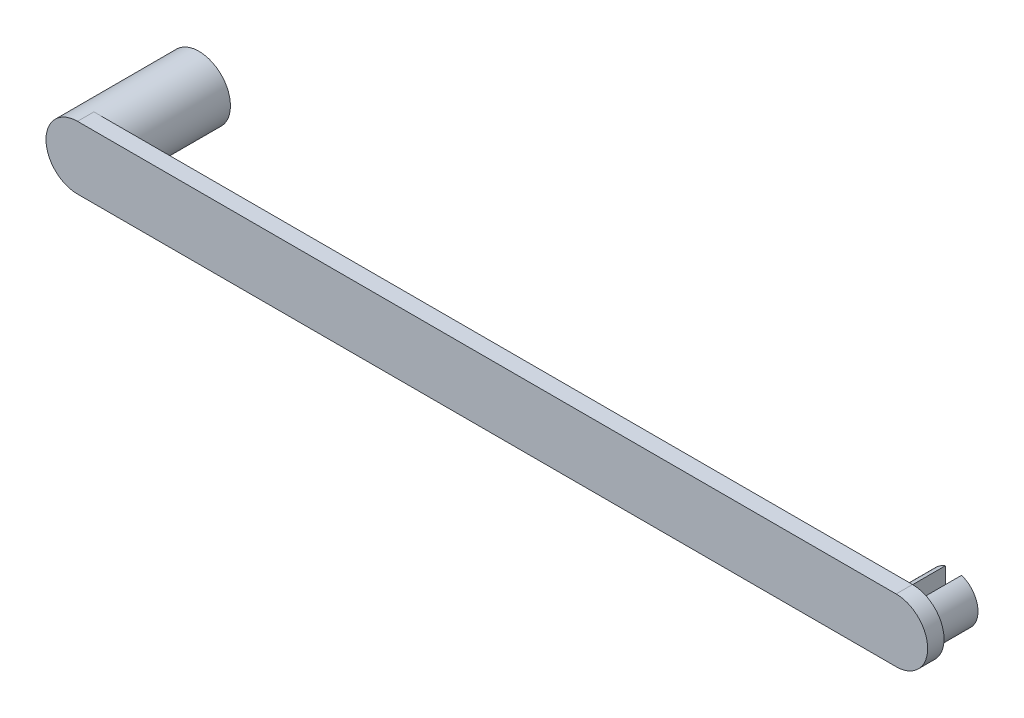
ISO-10303-21;
HEADER;
FILE_DESCRIPTION(('STEP AP214'),'2;1');
FILE_NAME('part.step','',(''),(''),'','','');
FILE_SCHEMA(('AUTOMOTIVE_DESIGN { 1 0 10303 214 1 1 1 1 }'));
ENDSEC;
DATA;
#1=APPLICATION_CONTEXT('core data for automotive mechanical design processes');
#2=APPLICATION_PROTOCOL_DEFINITION('international standard','automotive_design',2000,#1);
#3=PRODUCT_CONTEXT('',#1,'mechanical');
#4=PRODUCT('Part','Part','',(#3));
#5=PRODUCT_RELATED_PRODUCT_CATEGORY('part','',(#4));
#6=PRODUCT_DEFINITION_FORMATION('','',#4);
#7=PRODUCT_DEFINITION_CONTEXT('part definition',#1,'design');
#8=PRODUCT_DEFINITION('design','',#6,#7);
#9=PRODUCT_DEFINITION_SHAPE('','',#8);
#10=(LENGTH_UNIT() NAMED_UNIT(*) SI_UNIT(.MILLI.,.METRE.));
#11=(NAMED_UNIT(*) PLANE_ANGLE_UNIT() SI_UNIT($,.RADIAN.));
#12=(NAMED_UNIT(*) SI_UNIT($,.STERADIAN.) SOLID_ANGLE_UNIT());
#13=UNCERTAINTY_MEASURE_WITH_UNIT(LENGTH_MEASURE(1.E-05),#10,'distance_accuracy_value','');
#14=(GEOMETRIC_REPRESENTATION_CONTEXT(3) GLOBAL_UNCERTAINTY_ASSIGNED_CONTEXT((#13)) GLOBAL_UNIT_ASSIGNED_CONTEXT((#10,
#11,#12)) REPRESENTATION_CONTEXT('',''));
#15=CARTESIAN_POINT('',(0.,0.,0.));
#16=DIRECTION('',(0.,0.,1.));
#17=DIRECTION('',(1.,0.,0.));
#18=AXIS2_PLACEMENT_3D('',#15,#16,#17);
#19=CARTESIAN_POINT('',(0.,0.,12.83));
#20=DIRECTION('',(0.,0.,1.));
#21=DIRECTION('',(1.,0.,0.));
#22=AXIS2_PLACEMENT_3D('',#19,#20,#21);
#23=PLANE('',#22);
#24=DIRECTION('',(0.,-1.,0.));
#25=VECTOR('',#24,1.);
#26=CARTESIAN_POINT('',(99.,0.,12.83));
#27=LINE('',#26,#25);
#28=CARTESIAN_POINT('',(99.,2.8284271247462,12.83));
#29=VERTEX_POINT('',#28);
#30=CARTESIAN_POINT('',(99.,-2.8284271247462,12.83));
#31=VERTEX_POINT('',#30);
#32=EDGE_CURVE('E114',#29,#31,#27,.T.);
#33=ORIENTED_EDGE('',*,*,#32,.F.);
#34=CARTESIAN_POINT('',(100.,0.,12.83));
#35=DIRECTION('',(0.,0.,-1.));
#36=DIRECTION('',(-1.,0.,0.));
#37=AXIS2_PLACEMENT_3D('',#34,#35,#36);
#38=CIRCLE('',#37,3.00000000000001);
#39=EDGE_CURVE('E49',#31,#29,#38,.T.);
#40=ORIENTED_EDGE('',*,*,#39,.F.);
#41=EDGE_LOOP('',(#33,#40));
#42=FACE_BOUND('',#41,.T.);
#43=DIRECTION('',(1.,0.,0.));
#44=VECTOR('',#43,1.);
#45=CARTESIAN_POINT('',(0.,-3.85,12.83));
#46=LINE('',#45,#44);
#47=CARTESIAN_POINT('',(0.,-3.85,12.83));
#48=VERTEX_POINT('',#47);
#49=CARTESIAN_POINT('',(100.,-3.85,12.83));
#50=VERTEX_POINT('',#49);
#51=EDGE_CURVE('E136',#48,#50,#46,.T.);
#52=ORIENTED_EDGE('',*,*,#51,.F.);
#53=CARTESIAN_POINT('',(0.,0.,12.83));
#54=DIRECTION('',(0.,0.,1.));
#55=DIRECTION('',(1.,0.,0.));
#56=AXIS2_PLACEMENT_3D('',#53,#54,#55);
#57=CIRCLE('',#56,3.85);
#58=CARTESIAN_POINT('',(0.,3.85,12.83));
#59=VERTEX_POINT('',#58);
#60=EDGE_CURVE('E11',#48,#59,#57,.T.);
#61=ORIENTED_EDGE('',*,*,#60,.T.);
#62=DIRECTION('',(1.,0.,0.));
#63=VECTOR('',#62,1.);
#64=CARTESIAN_POINT('',(0.,3.85,12.83));
#65=LINE('',#64,#63);
#66=CARTESIAN_POINT('',(100.,3.85,12.83));
#67=VERTEX_POINT('',#66);
#68=EDGE_CURVE('E146',#59,#67,#65,.T.);
#69=ORIENTED_EDGE('',*,*,#68,.T.);
#70=CARTESIAN_POINT('',(100.,0.,12.83));
#71=DIRECTION('',(0.,0.,1.));
#72=DIRECTION('',(1.,0.,0.));
#73=AXIS2_PLACEMENT_3D('',#70,#71,#72);
#74=CIRCLE('',#73,3.85);
#75=EDGE_CURVE('E132',#50,#67,#74,.T.);
#76=ORIENTED_EDGE('',*,*,#75,.F.);
#77=EDGE_LOOP('',(#52,#61,#69,#76));
#78=FACE_BOUND('',#77,.T.);
#79=CARTESIAN_POINT('',(100.,0.,12.83));
#80=DIRECTION('',(0.,0.,-1.));
#81=DIRECTION('',(-1.,0.,0.));
#82=AXIS2_PLACEMENT_3D('',#79,#80,#81);
#83=CIRCLE('',#82,3.00000000000001);
#84=CARTESIAN_POINT('',(101.,2.8284271247462,12.83));
#85=VERTEX_POINT('',#84);
#86=CARTESIAN_POINT('',(101.,-2.8284271247462,12.83));
#87=VERTEX_POINT('',#86);
#88=EDGE_CURVE('E56',#85,#87,#83,.T.);
#89=ORIENTED_EDGE('',*,*,#88,.F.);
#90=DIRECTION('',(0.,-1.,0.));
#91=VECTOR('',#90,1.);
#92=CARTESIAN_POINT('',(101.,0.,12.83));
#93=LINE('',#92,#91);
#94=EDGE_CURVE('E115',#85,#87,#93,.T.);
#95=ORIENTED_EDGE('',*,*,#94,.T.);
#96=EDGE_LOOP('',(#89,#95));
#97=FACE_BOUND('',#96,.T.);
#98=ADVANCED_FACE('F35',(#42,#78,#97),#23,.F.);
#99=CARTESIAN_POINT('',(0.,0.,12.83));
#100=DIRECTION('',(0.,0.,-1.));
#101=DIRECTION('',(-1.,0.,0.));
#102=AXIS2_PLACEMENT_3D('',#99,#100,#101);
#103=CYLINDRICAL_SURFACE('',#102,3.85);
#104=ORIENTED_EDGE('',*,*,#60,.F.);
#105=DIRECTION('',(0.,0.,-1.));
#106=VECTOR('',#105,1.);
#107=CARTESIAN_POINT('',(0.,-3.85,14.83));
#108=LINE('',#107,#106);
#109=CARTESIAN_POINT('',(0.,-3.85,14.83));
#110=VERTEX_POINT('',#109);
#111=EDGE_CURVE('E152',#110,#48,#108,.T.);
#112=ORIENTED_EDGE('',*,*,#111,.F.);
#113=CARTESIAN_POINT('',(0.,0.,14.83));
#114=DIRECTION('',(0.,0.,1.));
#115=DIRECTION('',(1.,0.,0.));
#116=AXIS2_PLACEMENT_3D('',#113,#114,#115);
#117=CIRCLE('',#116,3.85);
#118=CARTESIAN_POINT('',(0.,3.85,14.83));
#119=VERTEX_POINT('',#118);
#120=EDGE_CURVE('E139',#119,#110,#117,.T.);
#121=ORIENTED_EDGE('',*,*,#120,.F.);
#122=DIRECTION('',(0.,0.,-1.));
#123=VECTOR('',#122,1.);
#124=CARTESIAN_POINT('',(0.,3.85,14.83));
#125=LINE('',#124,#123);
#126=EDGE_CURVE('E155',#119,#59,#125,.T.);
#127=ORIENTED_EDGE('',*,*,#126,.T.);
#128=EDGE_LOOP('',(#104,#112,#121,#127));
#129=FACE_BOUND('',#128,.T.);
#130=CARTESIAN_POINT('',(0.,0.,0.));
#131=DIRECTION('',(0.,0.,1.));
#132=DIRECTION('',(1.,0.,0.));
#133=AXIS2_PLACEMENT_3D('',#130,#131,#132);
#134=CIRCLE('',#133,3.85);
#135=CARTESIAN_POINT('',(3.85,0.,0.));
#136=VERTEX_POINT('',#135);
#137=EDGE_CURVE('E39',#136,#136,#134,.T.);
#138=ORIENTED_EDGE('',*,*,#137,.T.);
#139=EDGE_LOOP('',(#138));
#140=FACE_BOUND('',#139,.T.);
#141=ADVANCED_FACE('F37',(#129,#140),#103,.T.);
#142=CARTESIAN_POINT('',(0.,0.,0.));
#143=DIRECTION('',(0.,0.,1.));
#144=DIRECTION('',(1.,0.,0.));
#145=AXIS2_PLACEMENT_3D('',#142,#143,#144);
#146=PLANE('',#145);
#147=ORIENTED_EDGE('',*,*,#137,.F.);
#148=EDGE_LOOP('',(#147));
#149=FACE_BOUND('',#148,.T.);
#150=ADVANCED_FACE('F166',(#149),#146,.F.);
#151=CARTESIAN_POINT('',(100.,0.,14.83));
#152=DIRECTION('',(0.,0.,-1.));
#153=DIRECTION('',(-1.,0.,0.));
#154=AXIS2_PLACEMENT_3D('',#151,#152,#153);
#155=CYLINDRICAL_SURFACE('',#154,3.85);
#156=ORIENTED_EDGE('',*,*,#75,.T.);
#157=DIRECTION('',(0.,0.,-1.));
#158=VECTOR('',#157,1.);
#159=CARTESIAN_POINT('',(100.,3.85,14.83));
#160=LINE('',#159,#158);
#161=CARTESIAN_POINT('',(100.,3.85,14.83));
#162=VERTEX_POINT('',#161);
#163=EDGE_CURVE('E158',#162,#67,#160,.T.);
#164=ORIENTED_EDGE('',*,*,#163,.F.);
#165=CARTESIAN_POINT('',(100.,0.,14.83));
#166=DIRECTION('',(0.,0.,1.));
#167=DIRECTION('',(1.,0.,0.));
#168=AXIS2_PLACEMENT_3D('',#165,#166,#167);
#169=CIRCLE('',#168,3.85);
#170=CARTESIAN_POINT('',(100.,-3.85,14.83));
#171=VERTEX_POINT('',#170);
#172=EDGE_CURVE('E133',#171,#162,#169,.T.);
#173=ORIENTED_EDGE('',*,*,#172,.F.);
#174=DIRECTION('',(0.,0.,-1.));
#175=VECTOR('',#174,1.);
#176=CARTESIAN_POINT('',(100.,-3.85,14.83));
#177=LINE('',#176,#175);
#178=EDGE_CURVE('E143',#171,#50,#177,.T.);
#179=ORIENTED_EDGE('',*,*,#178,.T.);
#180=EDGE_LOOP('',(#156,#164,#173,#179));
#181=FACE_BOUND('',#180,.T.);
#182=ADVANCED_FACE('F168',(#181),#155,.T.);
#183=CARTESIAN_POINT('',(0.,3.85,14.83));
#184=DIRECTION('',(0.,1.,0.));
#185=DIRECTION('',(0.,0.,1.));
#186=AXIS2_PLACEMENT_3D('',#183,#184,#185);
#187=PLANE('',#186);
#188=ORIENTED_EDGE('',*,*,#68,.F.);
#189=ORIENTED_EDGE('',*,*,#126,.F.);
#190=DIRECTION('',(1.,0.,0.));
#191=VECTOR('',#190,1.);
#192=CARTESIAN_POINT('',(0.,3.85,14.83));
#193=LINE('',#192,#191);
#194=EDGE_CURVE('E135',#119,#162,#193,.T.);
#195=ORIENTED_EDGE('',*,*,#194,.T.);
#196=ORIENTED_EDGE('',*,*,#163,.T.);
#197=EDGE_LOOP('',(#188,#189,#195,#196));
#198=FACE_BOUND('',#197,.T.);
#199=ADVANCED_FACE('F173',(#198),#187,.T.);
#200=CARTESIAN_POINT('',(0.,-3.85,14.83));
#201=DIRECTION('',(0.,1.,0.));
#202=DIRECTION('',(0.,0.,1.));
#203=AXIS2_PLACEMENT_3D('',#200,#201,#202);
#204=PLANE('',#203);
#205=ORIENTED_EDGE('',*,*,#51,.T.);
#206=ORIENTED_EDGE('',*,*,#178,.F.);
#207=DIRECTION('',(1.,0.,0.));
#208=VECTOR('',#207,1.);
#209=CARTESIAN_POINT('',(0.,-3.85,14.83));
#210=LINE('',#209,#208);
#211=EDGE_CURVE('E141',#110,#171,#210,.T.);
#212=ORIENTED_EDGE('',*,*,#211,.F.);
#213=ORIENTED_EDGE('',*,*,#111,.T.);
#214=EDGE_LOOP('',(#205,#206,#212,#213));
#215=FACE_BOUND('',#214,.T.);
#216=ADVANCED_FACE('F186',(#215),#204,.F.);
#217=CARTESIAN_POINT('',(0.,0.,14.83));
#218=DIRECTION('',(0.,0.,1.));
#219=DIRECTION('',(1.,0.,0.));
#220=AXIS2_PLACEMENT_3D('',#217,#218,#219);
#221=PLANE('',#220);
#222=ORIENTED_EDGE('',*,*,#172,.T.);
#223=ORIENTED_EDGE('',*,*,#194,.F.);
#224=ORIENTED_EDGE('',*,*,#120,.T.);
#225=ORIENTED_EDGE('',*,*,#211,.T.);
#226=EDGE_LOOP('',(#222,#223,#224,#225));
#227=FACE_BOUND('',#226,.T.);
#228=ADVANCED_FACE('F184',(#227),#221,.T.);
#229=CARTESIAN_POINT('',(101.,0.,7.83));
#230=DIRECTION('',(-1.,0.,0.));
#231=DIRECTION('',(0.,0.,1.));
#232=AXIS2_PLACEMENT_3D('',#229,#230,#231);
#233=PLANE('',#232);
#234=ORIENTED_EDGE('',*,*,#94,.F.);
#235=DIRECTION('',(0.,0.,1.));
#236=VECTOR('',#235,1.);
#237=CARTESIAN_POINT('',(101.,2.8284271247462,7.83));
#238=LINE('',#237,#236);
#239=CARTESIAN_POINT('',(101.,2.8284271247462,7.83));
#240=VERTEX_POINT('',#239);
#241=EDGE_CURVE('E130',#240,#85,#238,.T.);
#242=ORIENTED_EDGE('',*,*,#241,.F.);
#243=DIRECTION('',(0.,-1.,0.));
#244=VECTOR('',#243,1.);
#245=CARTESIAN_POINT('',(101.,0.,7.83));
#246=LINE('',#245,#244);
#247=CARTESIAN_POINT('',(101.,-2.8284271247462,7.83));
#248=VERTEX_POINT('',#247);
#249=EDGE_CURVE('E121',#240,#248,#246,.T.);
#250=ORIENTED_EDGE('',*,*,#249,.T.);
#251=DIRECTION('',(0.,0.,1.));
#252=VECTOR('',#251,1.);
#253=CARTESIAN_POINT('',(101.,-2.8284271247462,7.83));
#254=LINE('',#253,#252);
#255=EDGE_CURVE('E125',#248,#87,#254,.T.);
#256=ORIENTED_EDGE('',*,*,#255,.T.);
#257=EDGE_LOOP('',(#234,#242,#250,#256));
#258=FACE_BOUND('',#257,.T.);
#259=ADVANCED_FACE('F203',(#258),#233,.T.);
#260=CARTESIAN_POINT('',(100.,0.,7.83));
#261=DIRECTION('',(0.,0.,1.));
#262=DIRECTION('',(1.,0.,0.));
#263=AXIS2_PLACEMENT_3D('',#260,#261,#262);
#264=CYLINDRICAL_SURFACE('',#263,3.00000000000001);
#265=ORIENTED_EDGE('',*,*,#88,.T.);
#266=ORIENTED_EDGE('',*,*,#255,.F.);
#267=CARTESIAN_POINT('',(100.,0.,7.83));
#268=DIRECTION('',(0.,0.,-1.));
#269=DIRECTION('',(-1.,0.,0.));
#270=AXIS2_PLACEMENT_3D('',#267,#268,#269);
#271=CIRCLE('',#270,3.00000000000001);
#272=EDGE_CURVE('E124',#240,#248,#271,.T.);
#273=ORIENTED_EDGE('',*,*,#272,.F.);
#274=ORIENTED_EDGE('',*,*,#241,.T.);
#275=EDGE_LOOP('',(#265,#266,#273,#274));
#276=FACE_BOUND('',#275,.T.);
#277=ADVANCED_FACE('F207',(#276),#264,.T.);
#278=CARTESIAN_POINT('',(0.,0.,7.83));
#279=DIRECTION('',(0.,0.,-1.));
#280=DIRECTION('',(-1.,0.,0.));
#281=AXIS2_PLACEMENT_3D('',#278,#279,#280);
#282=PLANE('',#281);
#283=ORIENTED_EDGE('',*,*,#249,.F.);
#284=ORIENTED_EDGE('',*,*,#272,.T.);
#285=EDGE_LOOP('',(#283,#284));
#286=FACE_BOUND('',#285,.T.);
#287=ADVANCED_FACE('F212',(#286),#282,.T.);
#288=CARTESIAN_POINT('',(99.,0.,7.83));
#289=DIRECTION('',(-1.,0.,0.));
#290=DIRECTION('',(0.,0.,1.));
#291=AXIS2_PLACEMENT_3D('',#288,#289,#290);
#292=PLANE('',#291);
#293=ORIENTED_EDGE('',*,*,#32,.T.);
#294=DIRECTION('',(0.,0.,1.));
#295=VECTOR('',#294,1.);
#296=CARTESIAN_POINT('',(99.,-2.8284271247462,7.83));
#297=LINE('',#296,#295);
#298=CARTESIAN_POINT('',(99.,-2.8284271247462,7.83));
#299=VERTEX_POINT('',#298);
#300=EDGE_CURVE('E102',#299,#31,#297,.T.);
#301=ORIENTED_EDGE('',*,*,#300,.F.);
#302=DIRECTION('',(0.,-1.,0.));
#303=VECTOR('',#302,1.);
#304=CARTESIAN_POINT('',(99.,0.,7.83));
#305=LINE('',#304,#303);
#306=CARTESIAN_POINT('',(99.,2.8284271247462,7.83));
#307=VERTEX_POINT('',#306);
#308=EDGE_CURVE('E108',#307,#299,#305,.T.);
#309=ORIENTED_EDGE('',*,*,#308,.F.);
#310=DIRECTION('',(0.,0.,1.));
#311=VECTOR('',#310,1.);
#312=CARTESIAN_POINT('',(99.,2.8284271247462,7.83));
#313=LINE('',#312,#311);
#314=EDGE_CURVE('E105',#307,#29,#313,.T.);
#315=ORIENTED_EDGE('',*,*,#314,.T.);
#316=EDGE_LOOP('',(#293,#301,#309,#315));
#317=FACE_BOUND('',#316,.T.);
#318=ADVANCED_FACE('F113',(#317),#292,.F.);
#319=CARTESIAN_POINT('',(100.,0.,7.83));
#320=DIRECTION('',(0.,0.,1.));
#321=DIRECTION('',(1.,0.,0.));
#322=AXIS2_PLACEMENT_3D('',#319,#320,#321);
#323=CYLINDRICAL_SURFACE('',#322,3.00000000000001);
#324=ORIENTED_EDGE('',*,*,#39,.T.);
#325=ORIENTED_EDGE('',*,*,#314,.F.);
#326=CARTESIAN_POINT('',(100.,0.,7.83));
#327=DIRECTION('',(0.,0.,-1.));
#328=DIRECTION('',(-1.,0.,0.));
#329=AXIS2_PLACEMENT_3D('',#326,#327,#328);
#330=CIRCLE('',#329,3.00000000000001);
#331=EDGE_CURVE('E98',#299,#307,#330,.T.);
#332=ORIENTED_EDGE('',*,*,#331,.F.);
#333=ORIENTED_EDGE('',*,*,#300,.T.);
#334=EDGE_LOOP('',(#324,#325,#332,#333));
#335=FACE_BOUND('',#334,.T.);
#336=ADVANCED_FACE('F100',(#335),#323,.T.);
#337=CARTESIAN_POINT('',(0.,0.,7.83));
#338=DIRECTION('',(0.,0.,-1.));
#339=DIRECTION('',(-1.,0.,0.));
#340=AXIS2_PLACEMENT_3D('',#337,#338,#339);
#341=PLANE('',#340);
#342=ORIENTED_EDGE('',*,*,#308,.T.);
#343=ORIENTED_EDGE('',*,*,#331,.T.);
#344=EDGE_LOOP('',(#342,#343));
#345=FACE_BOUND('',#344,.T.);
#346=ADVANCED_FACE('F110',(#345),#341,.T.);
#347=CLOSED_SHELL('',(#98,#141,#150,#182,#199,#216,#228,#259,#277,#287,#318,#336,#346));
#348=MANIFOLD_SOLID_BREP('B2',#347);
#349=ADVANCED_BREP_SHAPE_REPRESENTATION('',(#18,#348),#14);
#350=SHAPE_DEFINITION_REPRESENTATION(#9,#349);
ENDSEC;
END-ISO-10303-21;
